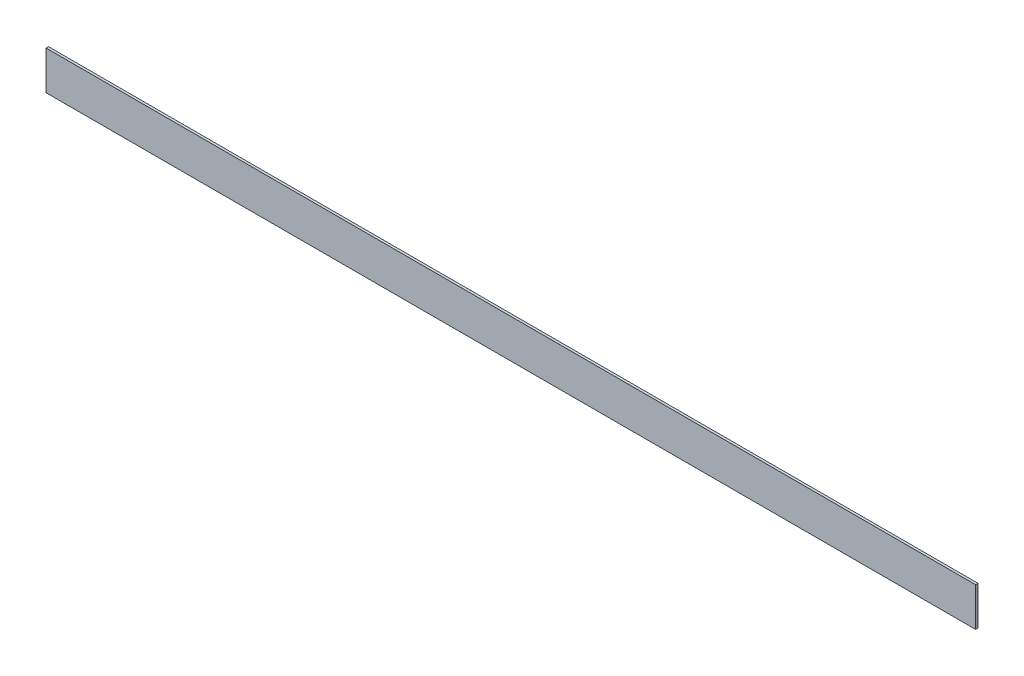
ISO-10303-21;
HEADER;
FILE_DESCRIPTION(('STEP AP214'),'2;1');
FILE_NAME('part.step','',(''),(''),'','','');
FILE_SCHEMA(('AUTOMOTIVE_DESIGN { 1 0 10303 214 1 1 1 1 }'));
ENDSEC;
DATA;
#1=APPLICATION_CONTEXT('core data for automotive mechanical design processes');
#2=APPLICATION_PROTOCOL_DEFINITION('international standard','automotive_design',2000,#1);
#3=PRODUCT_CONTEXT('',#1,'mechanical');
#4=PRODUCT('Part','Part','',(#3));
#5=PRODUCT_RELATED_PRODUCT_CATEGORY('part','',(#4));
#6=PRODUCT_DEFINITION_FORMATION('','',#4);
#7=PRODUCT_DEFINITION_CONTEXT('part definition',#1,'design');
#8=PRODUCT_DEFINITION('design','',#6,#7);
#9=PRODUCT_DEFINITION_SHAPE('','',#8);
#10=(LENGTH_UNIT() NAMED_UNIT(*) SI_UNIT(.MILLI.,.METRE.));
#11=(NAMED_UNIT(*) PLANE_ANGLE_UNIT() SI_UNIT($,.RADIAN.));
#12=(NAMED_UNIT(*) SI_UNIT($,.STERADIAN.) SOLID_ANGLE_UNIT());
#13=UNCERTAINTY_MEASURE_WITH_UNIT(LENGTH_MEASURE(1.E-05),#10,'distance_accuracy_value','');
#14=(GEOMETRIC_REPRESENTATION_CONTEXT(3) GLOBAL_UNCERTAINTY_ASSIGNED_CONTEXT((#13)) GLOBAL_UNIT_ASSIGNED_CONTEXT((#10,
#11,#12)) REPRESENTATION_CONTEXT('',''));
#15=CARTESIAN_POINT('',(0.,0.,0.));
#16=DIRECTION('',(0.,0.,1.));
#17=DIRECTION('',(1.,0.,0.));
#18=AXIS2_PLACEMENT_3D('',#15,#16,#17);
#19=CARTESIAN_POINT('',(304.8,12.7,1.58750000000007));
#20=DIRECTION('',(-1.,0.,0.));
#21=DIRECTION('',(0.,0.,0.999999999999999));
#22=AXIS2_PLACEMENT_3D('',#19,#20,#21);
#23=PLANE('',#22);
#24=DIRECTION('',(0.,1.,0.));
#25=VECTOR('',#24,1.);
#26=CARTESIAN_POINT('',(304.8,12.7,0.));
#27=LINE('',#26,#25);
#28=CARTESIAN_POINT('',(304.8,-12.7,0.));
#29=VERTEX_POINT('',#28);
#30=CARTESIAN_POINT('',(304.8,12.7,0.));
#31=VERTEX_POINT('',#30);
#32=EDGE_CURVE('E95',#29,#31,#27,.T.);
#33=ORIENTED_EDGE('',*,*,#32,.T.);
#34=DIRECTION('',(0.,0.,-0.999999999999999));
#35=VECTOR('',#34,1.);
#36=CARTESIAN_POINT('',(304.8,12.7,1.58750000000007));
#37=LINE('',#36,#35);
#38=CARTESIAN_POINT('',(304.8,12.7,1.58750000000007));
#39=VERTEX_POINT('',#38);
#40=EDGE_CURVE('E11',#39,#31,#37,.T.);
#41=ORIENTED_EDGE('',*,*,#40,.F.);
#42=DIRECTION('',(0.,1.,0.));
#43=VECTOR('',#42,1.);
#44=CARTESIAN_POINT('',(304.8,12.7,1.58750000000007));
#45=LINE('',#44,#43);
#46=CARTESIAN_POINT('',(304.8,-12.7,1.58750000000007));
#47=VERTEX_POINT('',#46);
#48=EDGE_CURVE('E83',#47,#39,#45,.T.);
#49=ORIENTED_EDGE('',*,*,#48,.F.);
#50=DIRECTION('',(0.,0.,-0.999999999999999));
#51=VECTOR('',#50,1.);
#52=CARTESIAN_POINT('',(304.8,-12.7,1.58750000000007));
#53=LINE('',#52,#51);
#54=EDGE_CURVE('E91',#47,#29,#53,.T.);
#55=ORIENTED_EDGE('',*,*,#54,.T.);
#56=EDGE_LOOP('',(#33,#41,#49,#55));
#57=FACE_BOUND('',#56,.T.);
#58=ADVANCED_FACE('F32',(#57),#23,.F.);
#59=CARTESIAN_POINT('',(-304.8,12.7,1.58749999999985));
#60=DIRECTION('',(0.,-1.,0.));
#61=DIRECTION('',(0.,0.,-0.999999999999999));
#62=AXIS2_PLACEMENT_3D('',#59,#60,#61);
#63=PLANE('',#62);
#64=DIRECTION('',(-1.,0.,0.));
#65=VECTOR('',#64,1.);
#66=CARTESIAN_POINT('',(-304.8,12.7,-2.22044604925031E-13));
#67=LINE('',#66,#65);
#68=CARTESIAN_POINT('',(-304.8,12.7,-2.22044604925031E-13));
#69=VERTEX_POINT('',#68);
#70=EDGE_CURVE('E87',#31,#69,#67,.T.);
#71=ORIENTED_EDGE('',*,*,#70,.T.);
#72=DIRECTION('',(0.,0.,-0.999999999999999));
#73=VECTOR('',#72,1.);
#74=CARTESIAN_POINT('',(-304.8,12.7,1.58749999999985));
#75=LINE('',#74,#73);
#76=CARTESIAN_POINT('',(-304.8,12.7,1.58749999999985));
#77=VERTEX_POINT('',#76);
#78=EDGE_CURVE('E40',#77,#69,#75,.T.);
#79=ORIENTED_EDGE('',*,*,#78,.F.);
#80=DIRECTION('',(-1.,0.,0.));
#81=VECTOR('',#80,1.);
#82=CARTESIAN_POINT('',(-304.8,12.7,1.58749999999985));
#83=LINE('',#82,#81);
#84=EDGE_CURVE('E78',#39,#77,#83,.T.);
#85=ORIENTED_EDGE('',*,*,#84,.F.);
#86=ORIENTED_EDGE('',*,*,#40,.T.);
#87=EDGE_LOOP('',(#71,#79,#85,#86));
#88=FACE_BOUND('',#87,.T.);
#89=ADVANCED_FACE('F86',(#88),#63,.F.);
#90=CARTESIAN_POINT('',(-304.8,12.7,1.58749999999985));
#91=DIRECTION('',(1.,0.,0.));
#92=DIRECTION('',(0.,0.,-0.999999999999999));
#93=AXIS2_PLACEMENT_3D('',#90,#91,#92);
#94=PLANE('',#93);
#95=DIRECTION('',(0.,-1.,0.));
#96=VECTOR('',#95,1.);
#97=CARTESIAN_POINT('',(-304.8,12.7,-2.22044604925031E-13));
#98=LINE('',#97,#96);
#99=CARTESIAN_POINT('',(-304.8,-12.7,-2.22044604925031E-13));
#100=VERTEX_POINT('',#99);
#101=EDGE_CURVE('E65',#69,#100,#98,.T.);
#102=ORIENTED_EDGE('',*,*,#101,.T.);
#103=DIRECTION('',(0.,0.,-0.999999999999999));
#104=VECTOR('',#103,1.);
#105=CARTESIAN_POINT('',(-304.8,-12.7,1.58749999999985));
#106=LINE('',#105,#104);
#107=CARTESIAN_POINT('',(-304.8,-12.7,1.58749999999985));
#108=VERTEX_POINT('',#107);
#109=EDGE_CURVE('E88',#108,#100,#106,.T.);
#110=ORIENTED_EDGE('',*,*,#109,.F.);
#111=DIRECTION('',(0.,-1.,0.));
#112=VECTOR('',#111,1.);
#113=CARTESIAN_POINT('',(-304.8,12.7,1.58749999999985));
#114=LINE('',#113,#112);
#115=EDGE_CURVE('E81',#77,#108,#114,.T.);
#116=ORIENTED_EDGE('',*,*,#115,.F.);
#117=ORIENTED_EDGE('',*,*,#78,.T.);
#118=EDGE_LOOP('',(#102,#110,#116,#117));
#119=FACE_BOUND('',#118,.T.);
#120=ADVANCED_FACE('F89',(#119),#94,.F.);
#121=CARTESIAN_POINT('',(-304.8,-12.7,1.58749999999985));
#122=DIRECTION('',(0.,1.,0.));
#123=DIRECTION('',(0.,0.,0.999999999999999));
#124=AXIS2_PLACEMENT_3D('',#121,#122,#123);
#125=PLANE('',#124);
#126=DIRECTION('',(1.,0.,0.));
#127=VECTOR('',#126,1.);
#128=CARTESIAN_POINT('',(-304.8,-12.7,-2.22044604925031E-13));
#129=LINE('',#128,#127);
#130=EDGE_CURVE('E71',#100,#29,#129,.T.);
#131=ORIENTED_EDGE('',*,*,#130,.T.);
#132=ORIENTED_EDGE('',*,*,#54,.F.);
#133=DIRECTION('',(1.,0.,0.));
#134=VECTOR('',#133,1.);
#135=CARTESIAN_POINT('',(-304.8,-12.7,1.58749999999985));
#136=LINE('',#135,#134);
#137=EDGE_CURVE('E48',#108,#47,#136,.T.);
#138=ORIENTED_EDGE('',*,*,#137,.F.);
#139=ORIENTED_EDGE('',*,*,#109,.T.);
#140=EDGE_LOOP('',(#131,#132,#138,#139));
#141=FACE_BOUND('',#140,.T.);
#142=ADVANCED_FACE('F102',(#141),#125,.F.);
#143=CARTESIAN_POINT('',(0.,0.,1.58750000000007));
#144=DIRECTION('',(0.,0.,0.999999999999999));
#145=DIRECTION('',(1.,0.,0.));
#146=AXIS2_PLACEMENT_3D('',#143,#144,#145);
#147=PLANE('',#146);
#148=ORIENTED_EDGE('',*,*,#48,.T.);
#149=ORIENTED_EDGE('',*,*,#84,.T.);
#150=ORIENTED_EDGE('',*,*,#115,.T.);
#151=ORIENTED_EDGE('',*,*,#137,.T.);
#152=EDGE_LOOP('',(#148,#149,#150,#151));
#153=FACE_BOUND('',#152,.T.);
#154=ADVANCED_FACE('F79',(#153),#147,.T.);
#155=CARTESIAN_POINT('',(0.,0.,0.));
#156=DIRECTION('',(0.,0.,0.999999999999999));
#157=DIRECTION('',(1.,0.,0.));
#158=AXIS2_PLACEMENT_3D('',#155,#156,#157);
#159=PLANE('',#158);
#160=ORIENTED_EDGE('',*,*,#32,.F.);
#161=ORIENTED_EDGE('',*,*,#130,.F.);
#162=ORIENTED_EDGE('',*,*,#101,.F.);
#163=ORIENTED_EDGE('',*,*,#70,.F.);
#164=EDGE_LOOP('',(#160,#161,#162,#163));
#165=FACE_BOUND('',#164,.T.);
#166=ADVANCED_FACE('F105',(#165),#159,.F.);
#167=CLOSED_SHELL('',(#58,#89,#120,#142,#154,#166));
#168=MANIFOLD_SOLID_BREP('B2',#167);
#169=ADVANCED_BREP_SHAPE_REPRESENTATION('',(#18,#168),#14);
#170=SHAPE_DEFINITION_REPRESENTATION(#9,#169);
ENDSEC;
END-ISO-10303-21;
